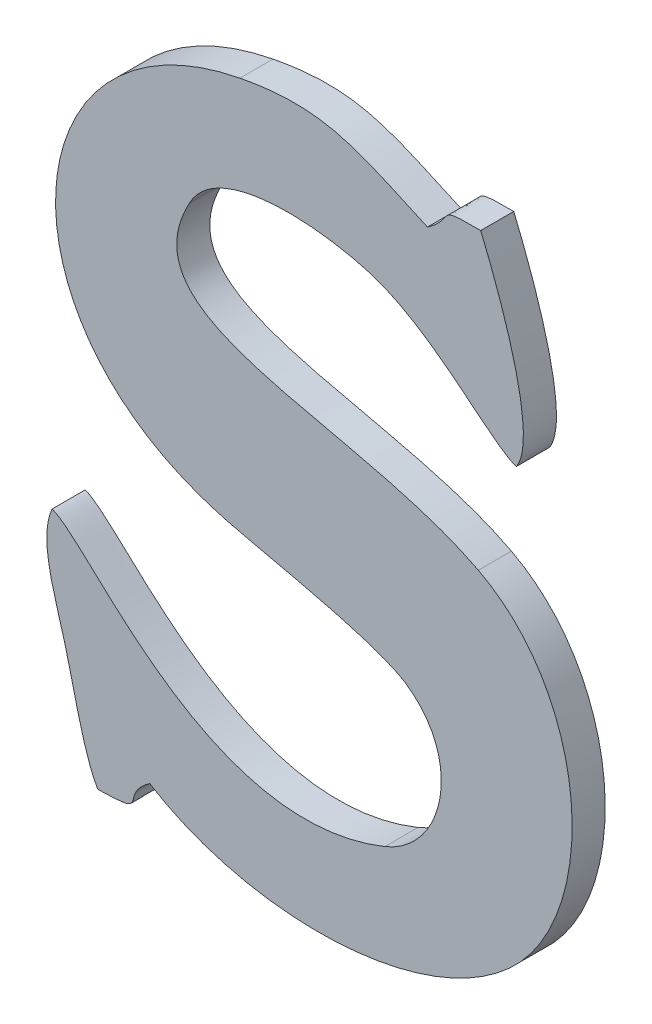
ISO-10303-21;
HEADER;
FILE_DESCRIPTION(('STEP AP214'),'2;1');
FILE_NAME('part.step','',(''),(''),'','','');
FILE_SCHEMA(('AUTOMOTIVE_DESIGN { 1 0 10303 214 1 1 1 1 }'));
ENDSEC;
DATA;
#1=APPLICATION_CONTEXT('core data for automotive mechanical design processes');
#2=APPLICATION_PROTOCOL_DEFINITION('international standard','automotive_design',2000,#1);
#3=PRODUCT_CONTEXT('',#1,'mechanical');
#4=PRODUCT('Part','Part','',(#3));
#5=PRODUCT_RELATED_PRODUCT_CATEGORY('part','',(#4));
#6=PRODUCT_DEFINITION_FORMATION('','',#4);
#7=PRODUCT_DEFINITION_CONTEXT('part definition',#1,'design');
#8=PRODUCT_DEFINITION('design','',#6,#7);
#9=PRODUCT_DEFINITION_SHAPE('','',#8);
#10=(LENGTH_UNIT() NAMED_UNIT(*) SI_UNIT(.MILLI.,.METRE.));
#11=(NAMED_UNIT(*) PLANE_ANGLE_UNIT() SI_UNIT($,.RADIAN.));
#12=(NAMED_UNIT(*) SI_UNIT($,.STERADIAN.) SOLID_ANGLE_UNIT());
#13=UNCERTAINTY_MEASURE_WITH_UNIT(LENGTH_MEASURE(1.E-05),#10,'distance_accuracy_value','');
#14=(GEOMETRIC_REPRESENTATION_CONTEXT(3) GLOBAL_UNCERTAINTY_ASSIGNED_CONTEXT((#13)) GLOBAL_UNIT_ASSIGNED_CONTEXT((#10,
#11,#12)) REPRESENTATION_CONTEXT('',''));
#15=CARTESIAN_POINT('',(0.,0.,0.));
#16=DIRECTION('',(0.,0.,1.));
#17=DIRECTION('',(1.,0.,0.));
#18=AXIS2_PLACEMENT_3D('',#15,#16,#17);
#19=CARTESIAN_POINT('',(50.1981159999998,11.237691,0.001));
#20=CARTESIAN_POINT('',(50.1981159999998,11.237691,0.));
#21=CARTESIAN_POINT('',(50.1998939999998,11.236487,0.001));
#22=CARTESIAN_POINT('',(50.1998939999998,11.236487,0.));
#23=CARTESIAN_POINT('',(50.1993199999998,11.233841,0.001));
#24=CARTESIAN_POINT('',(50.1993199999998,11.233841,0.));
#25=CARTESIAN_POINT('',(50.1974859999998,11.233099,0.001));
#26=CARTESIAN_POINT('',(50.1974859999998,11.233099,0.));
#27=B_SPLINE_SURFACE_WITH_KNOTS('',3,1,((#19,#20),(#21,#22),(#23,#24),(#25,#26)),.UNSPECIFIED.,
.F.,.F.,.F.,(4,4),(2,2),(0.8125,0.875),(0.,1.),.UNSPECIFIED.);
#28=CARTESIAN_POINT('',(50.1981159999998,11.237691,0.));
#29=CARTESIAN_POINT('',(50.1998939999998,11.236487,0.));
#30=CARTESIAN_POINT('',(50.1993199999998,11.233841,0.));
#31=CARTESIAN_POINT('',(50.1974859999998,11.233099,0.));
#32=B_SPLINE_CURVE_WITH_KNOTS('',3,(#28,#29,#30,#31),.UNSPECIFIED.,.F.,.F.,(4,4),(0.8125,0.875),.UNSPECIFIED.);
#33=CARTESIAN_POINT('',(50.1981159999998,11.237691,0.));
#34=VERTEX_POINT('',#33);
#35=CARTESIAN_POINT('',(50.1974859999998,11.233099,0.));
#36=VERTEX_POINT('',#35);
#37=EDGE_CURVE('E11',#34,#36,#32,.T.);
#38=DIRECTION('',(0.,0.,-1.));
#39=VECTOR('',#38,1.);
#40=CARTESIAN_POINT('',(50.1974859999998,11.233099,0.001));
#41=LINE('',#40,#39);
#42=CARTESIAN_POINT('',(50.1974859999998,11.233099,0.001));
#43=VERTEX_POINT('',#42);
#44=EDGE_CURVE('E28',#43,#36,#41,.T.);
#45=CARTESIAN_POINT('',(50.1981159999998,11.237691,0.001));
#46=CARTESIAN_POINT('',(50.1998939999998,11.236487,0.001));
#47=CARTESIAN_POINT('',(50.1993199999998,11.233841,0.001));
#48=CARTESIAN_POINT('',(50.1974859999998,11.233099,0.001));
#49=B_SPLINE_CURVE_WITH_KNOTS('',3,(#45,#46,#47,#48),.UNSPECIFIED.,.F.,.F.,(4,4),(0.8125,0.875),.UNSPECIFIED.);
#50=CARTESIAN_POINT('',(50.1981159999998,11.237691,0.001));
#51=VERTEX_POINT('',#50);
#52=EDGE_CURVE('E375',#51,#43,#49,.T.);
#53=DIRECTION('',(0.,0.,-1.));
#54=VECTOR('',#53,1.);
#55=CARTESIAN_POINT('',(50.1981159999998,11.237691,0.001));
#56=LINE('',#55,#54);
#57=EDGE_CURVE('E40',#51,#34,#56,.T.);
#58=ORIENTED_EDGE('',*,*,#37,.T.);
#59=ORIENTED_EDGE('',*,*,#44,.F.);
#60=ORIENTED_EDGE('',*,*,#52,.F.);
#61=ORIENTED_EDGE('',*,*,#57,.T.);
#62=EDGE_LOOP('',(#58,#59,#60,#61));
#63=FACE_BOUND('',#62,.T.);
#64=ADVANCED_FACE('F17',(#63),#27,.F.);
#65=CARTESIAN_POINT('',(50.1974859999998,11.233099,0.001));
#66=CARTESIAN_POINT('',(50.1974859999998,11.233099,0.));
#67=CARTESIAN_POINT('',(50.1921519999998,11.230957,0.001));
#68=CARTESIAN_POINT('',(50.1921519999998,11.230957,0.));
#69=CARTESIAN_POINT('',(50.1885399999998,11.236585,0.001));
#70=CARTESIAN_POINT('',(50.1885399999998,11.236585,0.));
#71=CARTESIAN_POINT('',(50.1874199999998,11.236907,0.001));
#72=CARTESIAN_POINT('',(50.1874199999998,11.236907,0.));
#73=B_SPLINE_SURFACE_WITH_KNOTS('',3,1,((#65,#66),(#67,#68),(#69,#70),(#71,#72)),.UNSPECIFIED.,
.F.,.F.,.F.,(4,4),(2,2),(0.875,1.),(0.,1.),.UNSPECIFIED.);
#74=CARTESIAN_POINT('',(50.1974859999998,11.233099,0.));
#75=CARTESIAN_POINT('',(50.1921519999998,11.230957,0.));
#76=CARTESIAN_POINT('',(50.1885399999998,11.236585,0.));
#77=CARTESIAN_POINT('',(50.1874199999998,11.236907,0.));
#78=B_SPLINE_CURVE_WITH_KNOTS('',3,(#74,#75,#76,#77),.UNSPECIFIED.,.F.,.F.,(4,4),(0.875,1.),.UNSPECIFIED.);
#79=CARTESIAN_POINT('',(50.1874199999998,11.236907,0.));
#80=VERTEX_POINT('',#79);
#81=EDGE_CURVE('E367',#36,#80,#78,.T.);
#82=DIRECTION('',(0.,0.,-1.));
#83=VECTOR('',#82,1.);
#84=CARTESIAN_POINT('',(50.1874199999998,11.236907,0.001));
#85=LINE('',#84,#83);
#86=CARTESIAN_POINT('',(50.1874199999998,11.236907,0.001));
#87=VERTEX_POINT('',#86);
#88=EDGE_CURVE('E362',#87,#80,#85,.T.);
#89=CARTESIAN_POINT('',(50.1974859999998,11.233099,0.001));
#90=CARTESIAN_POINT('',(50.1921519999998,11.230957,0.001));
#91=CARTESIAN_POINT('',(50.1885399999998,11.236585,0.001));
#92=CARTESIAN_POINT('',(50.1874199999998,11.236907,0.001));
#93=B_SPLINE_CURVE_WITH_KNOTS('',3,(#89,#90,#91,#92),.UNSPECIFIED.,.F.,.F.,(4,4),(0.875,1.),.UNSPECIFIED.);
#94=EDGE_CURVE('E355',#43,#87,#93,.T.);
#95=ORIENTED_EDGE('',*,*,#81,.T.);
#96=ORIENTED_EDGE('',*,*,#88,.F.);
#97=ORIENTED_EDGE('',*,*,#94,.F.);
#98=ORIENTED_EDGE('',*,*,#44,.T.);
#99=EDGE_LOOP('',(#95,#96,#97,#98));
#100=FACE_BOUND('',#99,.T.);
#101=ADVANCED_FACE('F383',(#100),#73,.F.);
#102=CARTESIAN_POINT('',(50.1874199999998,11.236907,0.001));
#103=CARTESIAN_POINT('',(50.1874199999998,11.236907,0.));
#104=CARTESIAN_POINT('',(50.1869999999998,11.235941,0.001));
#105=CARTESIAN_POINT('',(50.1869999999998,11.235941,0.));
#106=CARTESIAN_POINT('',(50.1875319999998,11.234625,0.001));
#107=CARTESIAN_POINT('',(50.1875319999998,11.234625,0.));
#108=CARTESIAN_POINT('',(50.1877979999998,11.233617,0.001));
#109=CARTESIAN_POINT('',(50.1877979999998,11.233617,0.));
#110=B_SPLINE_SURFACE_WITH_KNOTS('',3,1,((#102,#103),(#104,#105),(#106,#107),(#108,#109)),
.UNSPECIFIED.,.F.,.F.,.F.,(4,4),(2,2),(0.,0.0625),(0.,1.),.UNSPECIFIED.);
#111=CARTESIAN_POINT('',(50.1874199999998,11.236907,0.));
#112=CARTESIAN_POINT('',(50.1869999999998,11.235941,0.));
#113=CARTESIAN_POINT('',(50.1875319999998,11.234625,0.));
#114=CARTESIAN_POINT('',(50.1877979999998,11.233617,0.));
#115=B_SPLINE_CURVE_WITH_KNOTS('',3,(#111,#112,#113,#114),.UNSPECIFIED.,.F.,.F.,(4,4),(0.,
0.0625),.UNSPECIFIED.);
#116=CARTESIAN_POINT('',(50.1877979999998,11.233617,0.));
#117=VERTEX_POINT('',#116);
#118=EDGE_CURVE('E350',#80,#117,#115,.T.);
#119=DIRECTION('',(0.,0.,-1.));
#120=VECTOR('',#119,1.);
#121=CARTESIAN_POINT('',(50.1877979999998,11.233617,0.001));
#122=LINE('',#121,#120);
#123=CARTESIAN_POINT('',(50.1877979999998,11.233617,0.001));
#124=VERTEX_POINT('',#123);
#125=EDGE_CURVE('E345',#124,#117,#122,.T.);
#126=CARTESIAN_POINT('',(50.1874199999998,11.236907,0.001));
#127=CARTESIAN_POINT('',(50.1869999999998,11.235941,0.001));
#128=CARTESIAN_POINT('',(50.1875319999998,11.234625,0.001));
#129=CARTESIAN_POINT('',(50.1877979999998,11.233617,0.001));
#130=B_SPLINE_CURVE_WITH_KNOTS('',3,(#126,#127,#128,#129),.UNSPECIFIED.,.F.,.F.,(4,4),(0.,
0.0625),.UNSPECIFIED.);
#131=EDGE_CURVE('E338',#87,#124,#130,.T.);
#132=ORIENTED_EDGE('',*,*,#118,.T.);
#133=ORIENTED_EDGE('',*,*,#125,.F.);
#134=ORIENTED_EDGE('',*,*,#131,.F.);
#135=ORIENTED_EDGE('',*,*,#88,.T.);
#136=EDGE_LOOP('',(#132,#133,#134,#135));
#137=FACE_BOUND('',#136,.T.);
#138=ADVANCED_FACE('F388',(#137),#110,.F.);
#139=CARTESIAN_POINT('',(50.1877979999998,11.233617,0.001));
#140=CARTESIAN_POINT('',(50.1877979999998,11.233617,0.));
#141=CARTESIAN_POINT('',(50.1880359999998,11.232791,0.001));
#142=CARTESIAN_POINT('',(50.1880359999998,11.232791,0.));
#143=CARTESIAN_POINT('',(50.1883719999998,11.230943,0.001));
#144=CARTESIAN_POINT('',(50.1883719999998,11.230943,0.));
#145=CARTESIAN_POINT('',(50.1888059999998,11.230257,0.001));
#146=CARTESIAN_POINT('',(50.1888059999998,11.230257,0.));
#147=B_SPLINE_SURFACE_WITH_KNOTS('',3,1,((#139,#140),(#141,#142),(#143,#144),(#145,#146)),
.UNSPECIFIED.,.F.,.F.,.F.,(4,4),(2,2),(0.0625,0.125),(0.,1.),.UNSPECIFIED.);
#148=CARTESIAN_POINT('',(50.1877979999998,11.233617,0.));
#149=CARTESIAN_POINT('',(50.1880359999998,11.232791,0.));
#150=CARTESIAN_POINT('',(50.1883719999998,11.230943,0.));
#151=CARTESIAN_POINT('',(50.1888059999998,11.230257,0.));
#152=B_SPLINE_CURVE_WITH_KNOTS('',3,(#148,#149,#150,#151),.UNSPECIFIED.,.F.,.F.,(4,4),(0.0625,
0.125),.UNSPECIFIED.);
#153=CARTESIAN_POINT('',(50.1888059999998,11.230257,0.));
#154=VERTEX_POINT('',#153);
#155=EDGE_CURVE('E333',#117,#154,#152,.T.);
#156=DIRECTION('',(0.,0.,-1.));
#157=VECTOR('',#156,1.);
#158=CARTESIAN_POINT('',(50.1888059999998,11.230257,0.001));
#159=LINE('',#158,#157);
#160=CARTESIAN_POINT('',(50.1888059999998,11.230257,0.001));
#161=VERTEX_POINT('',#160);
#162=EDGE_CURVE('E328',#161,#154,#159,.T.);
#163=CARTESIAN_POINT('',(50.1877979999998,11.233617,0.001));
#164=CARTESIAN_POINT('',(50.1880359999998,11.232791,0.001));
#165=CARTESIAN_POINT('',(50.1883719999998,11.230943,0.001));
#166=CARTESIAN_POINT('',(50.1888059999998,11.230257,0.001));
#167=B_SPLINE_CURVE_WITH_KNOTS('',3,(#163,#164,#165,#166),.UNSPECIFIED.,.F.,.F.,(4,4),(0.0625,
0.125),.UNSPECIFIED.);
#168=EDGE_CURVE('E321',#124,#161,#167,.T.);
#169=ORIENTED_EDGE('',*,*,#155,.T.);
#170=ORIENTED_EDGE('',*,*,#162,.F.);
#171=ORIENTED_EDGE('',*,*,#168,.F.);
#172=ORIENTED_EDGE('',*,*,#125,.T.);
#173=EDGE_LOOP('',(#169,#170,#171,#172));
#174=FACE_BOUND('',#173,.T.);
#175=ADVANCED_FACE('F394',(#174),#147,.F.);
#176=CARTESIAN_POINT('',(50.1888059999998,11.230257,0.001));
#177=CARTESIAN_POINT('',(50.1888059999998,11.230257,0.));
#178=CARTESIAN_POINT('',(50.1905139999998,11.230285,0.001));
#179=CARTESIAN_POINT('',(50.1905139999998,11.230285,0.));
#180=CARTESIAN_POINT('',(50.1893799999998,11.230481,0.001));
#181=CARTESIAN_POINT('',(50.1893799999998,11.230481,0.));
#182=CARTESIAN_POINT('',(50.1903739999998,11.231195,0.001));
#183=CARTESIAN_POINT('',(50.1903739999998,11.231195,0.));
#184=B_SPLINE_SURFACE_WITH_KNOTS('',3,1,((#176,#177),(#178,#179),(#180,#181),(#182,#183)),
.UNSPECIFIED.,.F.,.F.,.F.,(4,4),(2,2),(0.125,0.1875),(0.,1.),.UNSPECIFIED.);
#185=CARTESIAN_POINT('',(50.1888059999998,11.230257,0.));
#186=CARTESIAN_POINT('',(50.1905139999998,11.230285,0.));
#187=CARTESIAN_POINT('',(50.1893799999998,11.230481,0.));
#188=CARTESIAN_POINT('',(50.1903739999998,11.231195,0.));
#189=B_SPLINE_CURVE_WITH_KNOTS('',3,(#185,#186,#187,#188),.UNSPECIFIED.,.F.,.F.,(4,4),(0.125,
0.1875),.UNSPECIFIED.);
#190=CARTESIAN_POINT('',(50.1903739999998,11.231195,0.));
#191=VERTEX_POINT('',#190);
#192=EDGE_CURVE('E316',#154,#191,#189,.T.);
#193=DIRECTION('',(0.,0.,-1.));
#194=VECTOR('',#193,1.);
#195=CARTESIAN_POINT('',(50.1903739999998,11.231195,0.001));
#196=LINE('',#195,#194);
#197=CARTESIAN_POINT('',(50.1903739999998,11.231195,0.001));
#198=VERTEX_POINT('',#197);
#199=EDGE_CURVE('E311',#198,#191,#196,.T.);
#200=CARTESIAN_POINT('',(50.1888059999998,11.230257,0.001));
#201=CARTESIAN_POINT('',(50.1905139999998,11.230285,0.001));
#202=CARTESIAN_POINT('',(50.1893799999998,11.230481,0.001));
#203=CARTESIAN_POINT('',(50.1903739999998,11.231195,0.001));
#204=B_SPLINE_CURVE_WITH_KNOTS('',3,(#200,#201,#202,#203),.UNSPECIFIED.,.F.,.F.,(4,4),(0.125,
0.1875),.UNSPECIFIED.);
#205=EDGE_CURVE('E304',#161,#198,#204,.T.);
#206=ORIENTED_EDGE('',*,*,#192,.T.);
#207=ORIENTED_EDGE('',*,*,#199,.F.);
#208=ORIENTED_EDGE('',*,*,#205,.F.);
#209=ORIENTED_EDGE('',*,*,#162,.T.);
#210=EDGE_LOOP('',(#206,#207,#208,#209));
#211=FACE_BOUND('',#210,.T.);
#212=ADVANCED_FACE('F398',(#211),#184,.F.);
#213=CARTESIAN_POINT('',(50.1903739999998,11.231195,0.001));
#214=CARTESIAN_POINT('',(50.1903739999998,11.231195,0.));
#215=CARTESIAN_POINT('',(50.1933839999998,11.229305,0.001));
#216=CARTESIAN_POINT('',(50.1933839999998,11.229305,0.));
#217=CARTESIAN_POINT('',(50.1985359999998,11.229333,0.001));
#218=CARTESIAN_POINT('',(50.1985359999998,11.229333,0.));
#219=CARTESIAN_POINT('',(50.2012519999998,11.231797,0.001));
#220=CARTESIAN_POINT('',(50.2012519999998,11.231797,0.));
#221=B_SPLINE_SURFACE_WITH_KNOTS('',3,1,((#213,#214),(#215,#216),(#217,#218),(#219,#220)),
.UNSPECIFIED.,.F.,.F.,.F.,(4,4),(2,2),(0.1875,0.25),(0.,1.),.UNSPECIFIED.);
#222=CARTESIAN_POINT('',(50.1903739999998,11.231195,0.));
#223=CARTESIAN_POINT('',(50.1933839999998,11.229305,0.));
#224=CARTESIAN_POINT('',(50.1985359999998,11.229333,0.));
#225=CARTESIAN_POINT('',(50.2012519999998,11.231797,0.));
#226=B_SPLINE_CURVE_WITH_KNOTS('',3,(#222,#223,#224,#225),.UNSPECIFIED.,.F.,.F.,(4,4),(0.1875,
0.25),.UNSPECIFIED.);
#227=CARTESIAN_POINT('',(50.2012519999998,11.231797,0.));
#228=VERTEX_POINT('',#227);
#229=EDGE_CURVE('E299',#191,#228,#226,.T.);
#230=DIRECTION('',(0.,0.,-1.));
#231=VECTOR('',#230,1.);
#232=CARTESIAN_POINT('',(50.2012519999998,11.231797,0.001));
#233=LINE('',#232,#231);
#234=CARTESIAN_POINT('',(50.2012519999998,11.231797,0.001));
#235=VERTEX_POINT('',#234);
#236=EDGE_CURVE('E294',#235,#228,#233,.T.);
#237=CARTESIAN_POINT('',(50.1903739999998,11.231195,0.001));
#238=CARTESIAN_POINT('',(50.1933839999998,11.229305,0.001));
#239=CARTESIAN_POINT('',(50.1985359999998,11.229333,0.001));
#240=CARTESIAN_POINT('',(50.2012519999998,11.231797,0.001));
#241=B_SPLINE_CURVE_WITH_KNOTS('',3,(#237,#238,#239,#240),.UNSPECIFIED.,.F.,.F.,(4,4),(0.1875,
0.25),.UNSPECIFIED.);
#242=EDGE_CURVE('E287',#198,#235,#241,.T.);
#243=ORIENTED_EDGE('',*,*,#229,.T.);
#244=ORIENTED_EDGE('',*,*,#236,.F.);
#245=ORIENTED_EDGE('',*,*,#242,.F.);
#246=ORIENTED_EDGE('',*,*,#199,.T.);
#247=EDGE_LOOP('',(#243,#244,#245,#246));
#248=FACE_BOUND('',#247,.T.);
#249=ADVANCED_FACE('F403',(#248),#221,.F.);
#250=CARTESIAN_POINT('',(50.2012519999998,11.231797,0.001));
#251=CARTESIAN_POINT('',(50.2012519999998,11.231797,0.));
#252=CARTESIAN_POINT('',(50.2040799999998,11.234359,0.001));
#253=CARTESIAN_POINT('',(50.2040799999998,11.234359,0.));
#254=CARTESIAN_POINT('',(50.2037299999998,11.239973,0.001));
#255=CARTESIAN_POINT('',(50.2037299999998,11.239973,0.));
#256=CARTESIAN_POINT('',(50.2003139999998,11.241751,0.001));
#257=CARTESIAN_POINT('',(50.2003139999998,11.241751,0.));
#258=B_SPLINE_SURFACE_WITH_KNOTS('',3,1,((#250,#251),(#252,#253),(#254,#255),(#256,#257)),
.UNSPECIFIED.,.F.,.F.,.F.,(4,4),(2,2),(0.25,0.3125),(0.,1.),.UNSPECIFIED.);
#259=CARTESIAN_POINT('',(50.2012519999998,11.231797,0.));
#260=CARTESIAN_POINT('',(50.2040799999998,11.234359,0.));
#261=CARTESIAN_POINT('',(50.2037299999998,11.239973,0.));
#262=CARTESIAN_POINT('',(50.2003139999998,11.241751,0.));
#263=B_SPLINE_CURVE_WITH_KNOTS('',3,(#259,#260,#261,#262),.UNSPECIFIED.,.F.,.F.,(4,4),(0.25,
0.3125),.UNSPECIFIED.);
#264=CARTESIAN_POINT('',(50.2003139999998,11.241751,0.));
#265=VERTEX_POINT('',#264);
#266=EDGE_CURVE('E282',#228,#265,#263,.T.);
#267=DIRECTION('',(0.,0.,-1.));
#268=VECTOR('',#267,1.);
#269=CARTESIAN_POINT('',(50.2003139999998,11.241751,0.001));
#270=LINE('',#269,#268);
#271=CARTESIAN_POINT('',(50.2003139999998,11.241751,0.001));
#272=VERTEX_POINT('',#271);
#273=EDGE_CURVE('E277',#272,#265,#270,.T.);
#274=CARTESIAN_POINT('',(50.2012519999998,11.231797,0.001));
#275=CARTESIAN_POINT('',(50.2040799999998,11.234359,0.001));
#276=CARTESIAN_POINT('',(50.2037299999998,11.239973,0.001));
#277=CARTESIAN_POINT('',(50.2003139999998,11.241751,0.001));
#278=B_SPLINE_CURVE_WITH_KNOTS('',3,(#274,#275,#276,#277),.UNSPECIFIED.,.F.,.F.,(4,4),(0.25,
0.3125),.UNSPECIFIED.);
#279=EDGE_CURVE('E270',#235,#272,#278,.T.);
#280=ORIENTED_EDGE('',*,*,#266,.T.);
#281=ORIENTED_EDGE('',*,*,#273,.F.);
#282=ORIENTED_EDGE('',*,*,#279,.F.);
#283=ORIENTED_EDGE('',*,*,#236,.T.);
#284=EDGE_LOOP('',(#280,#281,#282,#283));
#285=FACE_BOUND('',#284,.T.);
#286=ADVANCED_FACE('F409',(#285),#258,.F.);
#287=CARTESIAN_POINT('',(50.2003139999998,11.241751,0.001));
#288=CARTESIAN_POINT('',(50.2003139999998,11.241751,0.));
#289=CARTESIAN_POINT('',(50.1964639999998,11.243753,0.001));
#290=CARTESIAN_POINT('',(50.1964639999998,11.243753,0.));
#291=CARTESIAN_POINT('',(50.1894779999998,11.243109,0.001));
#292=CARTESIAN_POINT('',(50.1894779999998,11.243109,0.));
#293=CARTESIAN_POINT('',(50.1915779999998,11.247001,0.001));
#294=CARTESIAN_POINT('',(50.1915779999998,11.247001,0.));
#295=B_SPLINE_SURFACE_WITH_KNOTS('',3,1,((#287,#288),(#289,#290),(#291,#292),(#293,#294)),
.UNSPECIFIED.,.F.,.F.,.F.,(4,4),(2,2),(0.3125,0.375),(0.,1.),.UNSPECIFIED.);
#296=CARTESIAN_POINT('',(50.2003139999998,11.241751,0.));
#297=CARTESIAN_POINT('',(50.1964639999998,11.243753,0.));
#298=CARTESIAN_POINT('',(50.1894779999998,11.243109,0.));
#299=CARTESIAN_POINT('',(50.1915779999998,11.247001,0.));
#300=B_SPLINE_CURVE_WITH_KNOTS('',3,(#296,#297,#298,#299),.UNSPECIFIED.,.F.,.F.,(4,4),(0.3125,
0.375),.UNSPECIFIED.);
#301=CARTESIAN_POINT('',(50.1915779999998,11.247001,0.));
#302=VERTEX_POINT('',#301);
#303=EDGE_CURVE('E265',#265,#302,#300,.T.);
#304=DIRECTION('',(0.,0.,-1.));
#305=VECTOR('',#304,1.);
#306=CARTESIAN_POINT('',(50.1915779999998,11.247001,0.001));
#307=LINE('',#306,#305);
#308=CARTESIAN_POINT('',(50.1915779999998,11.247001,0.001));
#309=VERTEX_POINT('',#308);
#310=EDGE_CURVE('E260',#309,#302,#307,.T.);
#311=CARTESIAN_POINT('',(50.2003139999998,11.241751,0.001));
#312=CARTESIAN_POINT('',(50.1964639999998,11.243753,0.001));
#313=CARTESIAN_POINT('',(50.1894779999998,11.243109,0.001));
#314=CARTESIAN_POINT('',(50.1915779999998,11.247001,0.001));
#315=B_SPLINE_CURVE_WITH_KNOTS('',3,(#311,#312,#313,#314),.UNSPECIFIED.,.F.,.F.,(4,4),(0.3125,
0.375),.UNSPECIFIED.);
#316=EDGE_CURVE('E253',#272,#309,#315,.T.);
#317=ORIENTED_EDGE('',*,*,#303,.T.);
#318=ORIENTED_EDGE('',*,*,#310,.F.);
#319=ORIENTED_EDGE('',*,*,#316,.F.);
#320=ORIENTED_EDGE('',*,*,#273,.T.);
#321=EDGE_LOOP('',(#317,#318,#319,#320));
#322=FACE_BOUND('',#321,.T.);
#323=ADVANCED_FACE('F413',(#322),#295,.F.);
#324=CARTESIAN_POINT('',(50.1915779999998,11.247001,0.001));
#325=CARTESIAN_POINT('',(50.1915779999998,11.247001,0.));
#326=CARTESIAN_POINT('',(50.1924599999998,11.248653,0.001));
#327=CARTESIAN_POINT('',(50.1924599999998,11.248653,0.));
#328=CARTESIAN_POINT('',(50.1955959999998,11.248345,0.001));
#329=CARTESIAN_POINT('',(50.1955959999998,11.248345,0.));
#330=CARTESIAN_POINT('',(50.1970659999998,11.247883,0.001));
#331=CARTESIAN_POINT('',(50.1970659999998,11.247883,0.));
#332=B_SPLINE_SURFACE_WITH_KNOTS('',3,1,((#324,#325),(#326,#327),(#328,#329),(#330,#331)),
.UNSPECIFIED.,.F.,.F.,.F.,(4,4),(2,2),(0.375,0.4375),(0.,1.),.UNSPECIFIED.);
#333=CARTESIAN_POINT('',(50.1915779999998,11.247001,0.));
#334=CARTESIAN_POINT('',(50.1924599999998,11.248653,0.));
#335=CARTESIAN_POINT('',(50.1955959999998,11.248345,0.));
#336=CARTESIAN_POINT('',(50.1970659999998,11.247883,0.));
#337=B_SPLINE_CURVE_WITH_KNOTS('',3,(#333,#334,#335,#336),.UNSPECIFIED.,.F.,.F.,(4,4),(0.375,
0.4375),.UNSPECIFIED.);
#338=CARTESIAN_POINT('',(50.1970659999998,11.247883,0.));
#339=VERTEX_POINT('',#338);
#340=EDGE_CURVE('E248',#302,#339,#337,.T.);
#341=DIRECTION('',(0.,0.,-1.));
#342=VECTOR('',#341,1.);
#343=CARTESIAN_POINT('',(50.1970659999998,11.247883,0.001));
#344=LINE('',#343,#342);
#345=CARTESIAN_POINT('',(50.1970659999998,11.247883,0.001));
#346=VERTEX_POINT('',#345);
#347=EDGE_CURVE('E243',#346,#339,#344,.T.);
#348=CARTESIAN_POINT('',(50.1915779999998,11.247001,0.001));
#349=CARTESIAN_POINT('',(50.1924599999998,11.248653,0.001));
#350=CARTESIAN_POINT('',(50.1955959999998,11.248345,0.001));
#351=CARTESIAN_POINT('',(50.1970659999998,11.247883,0.001));
#352=B_SPLINE_CURVE_WITH_KNOTS('',3,(#348,#349,#350,#351),.UNSPECIFIED.,.F.,.F.,(4,4),(0.375,
0.4375),.UNSPECIFIED.);
#353=EDGE_CURVE('E236',#309,#346,#352,.T.);
#354=ORIENTED_EDGE('',*,*,#340,.T.);
#355=ORIENTED_EDGE('',*,*,#347,.F.);
#356=ORIENTED_EDGE('',*,*,#353,.F.);
#357=ORIENTED_EDGE('',*,*,#310,.T.);
#358=EDGE_LOOP('',(#354,#355,#356,#357));
#359=FACE_BOUND('',#358,.T.);
#360=ADVANCED_FACE('F418',(#359),#332,.F.);
#361=CARTESIAN_POINT('',(50.1970659999998,11.247883,0.001));
#362=CARTESIAN_POINT('',(50.1970659999998,11.247883,0.));
#363=CARTESIAN_POINT('',(50.1989979999998,11.247281,0.001));
#364=CARTESIAN_POINT('',(50.1989979999998,11.247281,0.));
#365=CARTESIAN_POINT('',(50.2006779999998,11.245279,0.001));
#366=CARTESIAN_POINT('',(50.2006779999998,11.245279,0.));
#367=CARTESIAN_POINT('',(50.2014619999998,11.245041,0.001));
#368=CARTESIAN_POINT('',(50.2014619999998,11.245041,0.));
#369=B_SPLINE_SURFACE_WITH_KNOTS('',3,1,((#361,#362),(#363,#364),(#365,#366),(#367,#368)),
.UNSPECIFIED.,.F.,.F.,.F.,(4,4),(2,2),(0.4375,0.5),(0.,1.),.UNSPECIFIED.);
#370=CARTESIAN_POINT('',(50.1970659999998,11.247883,0.));
#371=CARTESIAN_POINT('',(50.1989979999998,11.247281,0.));
#372=CARTESIAN_POINT('',(50.2006779999998,11.245279,0.));
#373=CARTESIAN_POINT('',(50.2014619999998,11.245041,0.));
#374=B_SPLINE_CURVE_WITH_KNOTS('',3,(#370,#371,#372,#373),.UNSPECIFIED.,.F.,.F.,(4,4),(0.4375,
0.5),.UNSPECIFIED.);
#375=CARTESIAN_POINT('',(50.2014619999998,11.245041,0.));
#376=VERTEX_POINT('',#375);
#377=EDGE_CURVE('E231',#339,#376,#374,.T.);
#378=DIRECTION('',(0.,0.,-1.));
#379=VECTOR('',#378,1.);
#380=CARTESIAN_POINT('',(50.2014619999998,11.245041,0.001));
#381=LINE('',#380,#379);
#382=CARTESIAN_POINT('',(50.2014619999998,11.245041,0.001));
#383=VERTEX_POINT('',#382);
#384=EDGE_CURVE('E226',#383,#376,#381,.T.);
#385=CARTESIAN_POINT('',(50.1970659999998,11.247883,0.001));
#386=CARTESIAN_POINT('',(50.1989979999998,11.247281,0.001));
#387=CARTESIAN_POINT('',(50.2006779999998,11.245279,0.001));
#388=CARTESIAN_POINT('',(50.2014619999998,11.245041,0.001));
#389=B_SPLINE_CURVE_WITH_KNOTS('',3,(#385,#386,#387,#388),.UNSPECIFIED.,.F.,.F.,(4,4),(0.4375,
0.5),.UNSPECIFIED.);
#390=EDGE_CURVE('E219',#346,#383,#389,.T.);
#391=ORIENTED_EDGE('',*,*,#377,.T.);
#392=ORIENTED_EDGE('',*,*,#384,.F.);
#393=ORIENTED_EDGE('',*,*,#390,.F.);
#394=ORIENTED_EDGE('',*,*,#347,.T.);
#395=EDGE_LOOP('',(#391,#392,#393,#394));
#396=FACE_BOUND('',#395,.T.);
#397=ADVANCED_FACE('F424',(#396),#369,.F.);
#398=CARTESIAN_POINT('',(50.2014619999998,11.245041,0.001));
#399=CARTESIAN_POINT('',(50.2014619999998,11.245041,0.));
#400=CARTESIAN_POINT('',(50.2021759999998,11.246105,0.001));
#401=CARTESIAN_POINT('',(50.2021759999998,11.246105,0.));
#402=CARTESIAN_POINT('',(50.2009019999998,11.249465,0.001));
#403=CARTESIAN_POINT('',(50.2009019999998,11.249465,0.));
#404=CARTESIAN_POINT('',(50.2003839999998,11.250683,0.001));
#405=CARTESIAN_POINT('',(50.2003839999998,11.250683,0.));
#406=B_SPLINE_SURFACE_WITH_KNOTS('',3,1,((#398,#399),(#400,#401),(#402,#403),(#404,#405)),
.UNSPECIFIED.,.F.,.F.,.F.,(4,4),(2,2),(0.5,0.5625),(0.,1.),.UNSPECIFIED.);
#407=CARTESIAN_POINT('',(50.2014619999998,11.245041,0.));
#408=CARTESIAN_POINT('',(50.2021759999998,11.246105,0.));
#409=CARTESIAN_POINT('',(50.2009019999998,11.249465,0.));
#410=CARTESIAN_POINT('',(50.2003839999998,11.250683,0.));
#411=B_SPLINE_CURVE_WITH_KNOTS('',3,(#407,#408,#409,#410),.UNSPECIFIED.,.F.,.F.,(4,4),(0.5,
0.5625),.UNSPECIFIED.);
#412=CARTESIAN_POINT('',(50.2003839999998,11.250683,0.));
#413=VERTEX_POINT('',#412);
#414=EDGE_CURVE('E214',#376,#413,#411,.T.);
#415=DIRECTION('',(0.,0.,-1.));
#416=VECTOR('',#415,1.);
#417=CARTESIAN_POINT('',(50.2003839999998,11.250683,0.001));
#418=LINE('',#417,#416);
#419=CARTESIAN_POINT('',(50.2003839999998,11.250683,0.001));
#420=VERTEX_POINT('',#419);
#421=EDGE_CURVE('E209',#420,#413,#418,.T.);
#422=CARTESIAN_POINT('',(50.2014619999998,11.245041,0.001));
#423=CARTESIAN_POINT('',(50.2021759999998,11.246105,0.001));
#424=CARTESIAN_POINT('',(50.2009019999998,11.249465,0.001));
#425=CARTESIAN_POINT('',(50.2003839999998,11.250683,0.001));
#426=B_SPLINE_CURVE_WITH_KNOTS('',3,(#422,#423,#424,#425),.UNSPECIFIED.,.F.,.F.,(4,4),(0.5,
0.5625),.UNSPECIFIED.);
#427=EDGE_CURVE('E202',#383,#420,#426,.T.);
#428=ORIENTED_EDGE('',*,*,#414,.T.);
#429=ORIENTED_EDGE('',*,*,#421,.F.);
#430=ORIENTED_EDGE('',*,*,#427,.F.);
#431=ORIENTED_EDGE('',*,*,#384,.T.);
#432=EDGE_LOOP('',(#428,#429,#430,#431));
#433=FACE_BOUND('',#432,.T.);
#434=ADVANCED_FACE('F428',(#433),#406,.F.);
#435=CARTESIAN_POINT('',(50.2003839999998,11.250683,0.001));
#436=CARTESIAN_POINT('',(50.2003839999998,11.250683,0.));
#437=CARTESIAN_POINT('',(50.1989139999998,11.250697,0.001));
#438=CARTESIAN_POINT('',(50.1989139999998,11.250697,0.));
#439=CARTESIAN_POINT('',(50.1996839999998,11.250599,0.001));
#440=CARTESIAN_POINT('',(50.1996839999998,11.250599,0.));
#441=CARTESIAN_POINT('',(50.1987739999998,11.249969,0.001));
#442=CARTESIAN_POINT('',(50.1987739999998,11.249969,0.));
#443=B_SPLINE_SURFACE_WITH_KNOTS('',3,1,((#435,#436),(#437,#438),(#439,#440),(#441,#442)),
.UNSPECIFIED.,.F.,.F.,.F.,(4,4),(2,2),(0.5625,0.625),(0.,1.),.UNSPECIFIED.);
#444=CARTESIAN_POINT('',(50.2003839999998,11.250683,0.));
#445=CARTESIAN_POINT('',(50.1989139999998,11.250697,0.));
#446=CARTESIAN_POINT('',(50.1996839999998,11.250599,0.));
#447=CARTESIAN_POINT('',(50.1987739999998,11.249969,0.));
#448=B_SPLINE_CURVE_WITH_KNOTS('',3,(#444,#445,#446,#447),.UNSPECIFIED.,.F.,.F.,(4,4),(0.5625,
0.625),.UNSPECIFIED.);
#449=CARTESIAN_POINT('',(50.1987739999998,11.249969,0.));
#450=VERTEX_POINT('',#449);
#451=EDGE_CURVE('E197',#413,#450,#448,.T.);
#452=DIRECTION('',(0.,0.,-1.));
#453=VECTOR('',#452,1.);
#454=CARTESIAN_POINT('',(50.1987739999998,11.249969,0.001));
#455=LINE('',#454,#453);
#456=CARTESIAN_POINT('',(50.1987739999998,11.249969,0.001));
#457=VERTEX_POINT('',#456);
#458=EDGE_CURVE('E192',#457,#450,#455,.T.);
#459=CARTESIAN_POINT('',(50.2003839999998,11.250683,0.001));
#460=CARTESIAN_POINT('',(50.1989139999998,11.250697,0.001));
#461=CARTESIAN_POINT('',(50.1996839999998,11.250599,0.001));
#462=CARTESIAN_POINT('',(50.1987739999998,11.249969,0.001));
#463=B_SPLINE_CURVE_WITH_KNOTS('',3,(#459,#460,#461,#462),.UNSPECIFIED.,.F.,.F.,(4,4),(0.5625,
0.625),.UNSPECIFIED.);
#464=EDGE_CURVE('E185',#420,#457,#463,.T.);
#465=ORIENTED_EDGE('',*,*,#451,.T.);
#466=ORIENTED_EDGE('',*,*,#458,.F.);
#467=ORIENTED_EDGE('',*,*,#464,.F.);
#468=ORIENTED_EDGE('',*,*,#421,.T.);
#469=EDGE_LOOP('',(#465,#466,#467,#468));
#470=FACE_BOUND('',#469,.T.);
#471=ADVANCED_FACE('F433',(#470),#443,.F.);
#472=CARTESIAN_POINT('',(50.1987739999998,11.249969,0.001));
#473=CARTESIAN_POINT('',(50.1987739999998,11.249969,0.));
#474=CARTESIAN_POINT('',(50.1965899999998,11.250949,0.001));
#475=CARTESIAN_POINT('',(50.1965899999998,11.250949,0.));
#476=CARTESIAN_POINT('',(50.1956519999998,11.251523,0.001));
#477=CARTESIAN_POINT('',(50.1956519999998,11.251523,0.));
#478=CARTESIAN_POINT('',(50.1931039999998,11.251033,0.001));
#479=CARTESIAN_POINT('',(50.1931039999998,11.251033,0.));
#480=B_SPLINE_SURFACE_WITH_KNOTS('',3,1,((#472,#473),(#474,#475),(#476,#477),(#478,#479)),
.UNSPECIFIED.,.F.,.F.,.F.,(4,4),(2,2),(0.625,0.6875),(0.,1.),.UNSPECIFIED.);
#481=CARTESIAN_POINT('',(50.1987739999998,11.249969,0.));
#482=CARTESIAN_POINT('',(50.1965899999998,11.250949,0.));
#483=CARTESIAN_POINT('',(50.1956519999998,11.251523,0.));
#484=CARTESIAN_POINT('',(50.1931039999998,11.251033,0.));
#485=B_SPLINE_CURVE_WITH_KNOTS('',3,(#481,#482,#483,#484),.UNSPECIFIED.,.F.,.F.,(4,4),(0.625,
0.6875),.UNSPECIFIED.);
#486=CARTESIAN_POINT('',(50.1931039999998,11.251033,0.));
#487=VERTEX_POINT('',#486);
#488=EDGE_CURVE('E180',#450,#487,#485,.T.);
#489=DIRECTION('',(0.,0.,-1.));
#490=VECTOR('',#489,1.);
#491=CARTESIAN_POINT('',(50.1931039999998,11.251033,0.001));
#492=LINE('',#491,#490);
#493=CARTESIAN_POINT('',(50.1931039999998,11.251033,0.001));
#494=VERTEX_POINT('',#493);
#495=EDGE_CURVE('E175',#494,#487,#492,.T.);
#496=CARTESIAN_POINT('',(50.1987739999998,11.249969,0.001));
#497=CARTESIAN_POINT('',(50.1965899999998,11.250949,0.001));
#498=CARTESIAN_POINT('',(50.1956519999998,11.251523,0.001));
#499=CARTESIAN_POINT('',(50.1931039999998,11.251033,0.001));
#500=B_SPLINE_CURVE_WITH_KNOTS('',3,(#496,#497,#498,#499),.UNSPECIFIED.,.F.,.F.,(4,4),(0.625,
0.6875),.UNSPECIFIED.);
#501=EDGE_CURVE('E133',#457,#494,#500,.T.);
#502=ORIENTED_EDGE('',*,*,#488,.T.);
#503=ORIENTED_EDGE('',*,*,#495,.F.);
#504=ORIENTED_EDGE('',*,*,#501,.F.);
#505=ORIENTED_EDGE('',*,*,#458,.T.);
#506=EDGE_LOOP('',(#502,#503,#504,#505));
#507=FACE_BOUND('',#506,.T.);
#508=ADVANCED_FACE('F436',(#507),#480,.F.);
#509=CARTESIAN_POINT('',(50.1931039999998,11.251033,0.001));
#510=CARTESIAN_POINT('',(50.1931039999998,11.251033,0.));
#511=CARTESIAN_POINT('',(50.1862439999998,11.249717,0.001));
#512=CARTESIAN_POINT('',(50.1862439999998,11.249717,0.));
#513=CARTESIAN_POINT('',(50.1852779999998,11.241219,0.001));
#514=CARTESIAN_POINT('',(50.1852779999998,11.241219,0.));
#515=CARTESIAN_POINT('',(50.1926559999998,11.239259,0.001));
#516=CARTESIAN_POINT('',(50.1926559999998,11.239259,0.));
#517=B_SPLINE_SURFACE_WITH_KNOTS('',3,1,((#509,#510),(#511,#512),(#513,#514),(#515,#516)),
.UNSPECIFIED.,.F.,.F.,.F.,(4,4),(2,2),(0.6875,0.75),(0.,1.),.UNSPECIFIED.);
#518=CARTESIAN_POINT('',(50.1931039999998,11.251033,0.));
#519=CARTESIAN_POINT('',(50.1862439999998,11.249717,0.));
#520=CARTESIAN_POINT('',(50.1852779999998,11.241219,0.));
#521=CARTESIAN_POINT('',(50.1926559999998,11.239259,0.));
#522=B_SPLINE_CURVE_WITH_KNOTS('',3,(#518,#519,#520,#521),.UNSPECIFIED.,.F.,.F.,(4,4),(0.6875,
0.75),.UNSPECIFIED.);
#523=CARTESIAN_POINT('',(50.1926559999998,11.239259,0.));
#524=VERTEX_POINT('',#523);
#525=EDGE_CURVE('E142',#487,#524,#522,.T.);
#526=DIRECTION('',(0.,0.,-1.));
#527=VECTOR('',#526,1.);
#528=CARTESIAN_POINT('',(50.1926559999998,11.239259,0.001));
#529=LINE('',#528,#527);
#530=CARTESIAN_POINT('',(50.1926559999998,11.239259,0.001));
#531=VERTEX_POINT('',#530);
#532=EDGE_CURVE('E136',#531,#524,#529,.T.);
#533=CARTESIAN_POINT('',(50.1931039999998,11.251033,0.001));
#534=CARTESIAN_POINT('',(50.1862439999998,11.249717,0.001));
#535=CARTESIAN_POINT('',(50.1852779999998,11.241219,0.001));
#536=CARTESIAN_POINT('',(50.1926559999998,11.239259,0.001));
#537=B_SPLINE_CURVE_WITH_KNOTS('',3,(#533,#534,#535,#536),.UNSPECIFIED.,.F.,.F.,(4,4),(0.6875,
0.75),.UNSPECIFIED.);
#538=EDGE_CURVE('E127',#494,#531,#537,.T.);
#539=ORIENTED_EDGE('',*,*,#525,.T.);
#540=ORIENTED_EDGE('',*,*,#532,.F.);
#541=ORIENTED_EDGE('',*,*,#538,.F.);
#542=ORIENTED_EDGE('',*,*,#495,.T.);
#543=EDGE_LOOP('',(#539,#540,#541,#542));
#544=FACE_BOUND('',#543,.T.);
#545=ADVANCED_FACE('F140',(#544),#517,.F.);
#546=CARTESIAN_POINT('',(50.1926559999998,11.239259,0.001));
#547=CARTESIAN_POINT('',(50.1926559999998,11.239259,0.));
#548=CARTESIAN_POINT('',(50.1939299999998,11.238923,0.001));
#549=CARTESIAN_POINT('',(50.1939299999998,11.238923,0.));
#550=CARTESIAN_POINT('',(50.1971219999998,11.238349,0.001));
#551=CARTESIAN_POINT('',(50.1971219999998,11.238349,0.));
#552=CARTESIAN_POINT('',(50.1981159999998,11.237691,0.001));
#553=CARTESIAN_POINT('',(50.1981159999998,11.237691,0.));
#554=B_SPLINE_SURFACE_WITH_KNOTS('',3,1,((#546,#547),(#548,#549),(#550,#551),(#552,#553)),
.UNSPECIFIED.,.F.,.F.,.F.,(4,4),(2,2),(0.75,0.8125),(0.,1.),.UNSPECIFIED.);
#555=CARTESIAN_POINT('',(50.1926559999998,11.239259,0.));
#556=CARTESIAN_POINT('',(50.1939299999998,11.238923,0.));
#557=CARTESIAN_POINT('',(50.1971219999998,11.238349,0.));
#558=CARTESIAN_POINT('',(50.1981159999998,11.237691,0.));
#559=B_SPLINE_CURVE_WITH_KNOTS('',3,(#555,#556,#557,#558),.UNSPECIFIED.,.F.,.F.,(4,4),(0.75,
0.8125),.UNSPECIFIED.);
#560=EDGE_CURVE('E137',#524,#34,#559,.T.);
#561=CARTESIAN_POINT('',(50.1926559999998,11.239259,0.001));
#562=CARTESIAN_POINT('',(50.1939299999998,11.238923,0.001));
#563=CARTESIAN_POINT('',(50.1971219999998,11.238349,0.001));
#564=CARTESIAN_POINT('',(50.1981159999998,11.237691,0.001));
#565=B_SPLINE_CURVE_WITH_KNOTS('',3,(#561,#562,#563,#564),.UNSPECIFIED.,.F.,.F.,(4,4),(0.75,
0.8125),.UNSPECIFIED.);
#566=EDGE_CURVE('E131',#531,#51,#565,.T.);
#567=ORIENTED_EDGE('',*,*,#560,.T.);
#568=ORIENTED_EDGE('',*,*,#57,.F.);
#569=ORIENTED_EDGE('',*,*,#566,.F.);
#570=ORIENTED_EDGE('',*,*,#532,.T.);
#571=EDGE_LOOP('',(#567,#568,#569,#570));
#572=FACE_BOUND('',#571,.T.);
#573=ADVANCED_FACE('F147',(#572),#554,.F.);
#574=CARTESIAN_POINT('',(0.,0.,0.001));
#575=DIRECTION('',(0.,0.,1.));
#576=DIRECTION('',(1.,0.,0.));
#577=AXIS2_PLACEMENT_3D('',#574,#575,#576);
#578=PLANE('',#577);
#579=ORIENTED_EDGE('',*,*,#52,.T.);
#580=ORIENTED_EDGE('',*,*,#94,.T.);
#581=ORIENTED_EDGE('',*,*,#131,.T.);
#582=ORIENTED_EDGE('',*,*,#168,.T.);
#583=ORIENTED_EDGE('',*,*,#205,.T.);
#584=ORIENTED_EDGE('',*,*,#242,.T.);
#585=ORIENTED_EDGE('',*,*,#279,.T.);
#586=ORIENTED_EDGE('',*,*,#316,.T.);
#587=ORIENTED_EDGE('',*,*,#353,.T.);
#588=ORIENTED_EDGE('',*,*,#390,.T.);
#589=ORIENTED_EDGE('',*,*,#427,.T.);
#590=ORIENTED_EDGE('',*,*,#464,.T.);
#591=ORIENTED_EDGE('',*,*,#501,.T.);
#592=ORIENTED_EDGE('',*,*,#538,.T.);
#593=ORIENTED_EDGE('',*,*,#566,.T.);
#594=EDGE_LOOP('',(#579,#580,#581,#582,#583,#584,#585,#586,#587,#588,#589,#590,#591,#592,#593));
#595=FACE_BOUND('',#594,.T.);
#596=ADVANCED_FACE('F129',(#595),#578,.T.);
#597=CARTESIAN_POINT('',(0.,0.,0.));
#598=DIRECTION('',(0.,0.,1.));
#599=DIRECTION('',(1.,0.,0.));
#600=AXIS2_PLACEMENT_3D('',#597,#598,#599);
#601=PLANE('',#600);
#602=ORIENTED_EDGE('',*,*,#37,.F.);
#603=ORIENTED_EDGE('',*,*,#560,.F.);
#604=ORIENTED_EDGE('',*,*,#525,.F.);
#605=ORIENTED_EDGE('',*,*,#488,.F.);
#606=ORIENTED_EDGE('',*,*,#451,.F.);
#607=ORIENTED_EDGE('',*,*,#414,.F.);
#608=ORIENTED_EDGE('',*,*,#377,.F.);
#609=ORIENTED_EDGE('',*,*,#340,.F.);
#610=ORIENTED_EDGE('',*,*,#303,.F.);
#611=ORIENTED_EDGE('',*,*,#266,.F.);
#612=ORIENTED_EDGE('',*,*,#229,.F.);
#613=ORIENTED_EDGE('',*,*,#192,.F.);
#614=ORIENTED_EDGE('',*,*,#155,.F.);
#615=ORIENTED_EDGE('',*,*,#118,.F.);
#616=ORIENTED_EDGE('',*,*,#81,.F.);
#617=EDGE_LOOP('',(#602,#603,#604,#605,#606,#607,#608,#609,#610,#611,#612,#613,#614,#615,#616));
#618=FACE_BOUND('',#617,.T.);
#619=ADVANCED_FACE('F438',(#618),#601,.F.);
#620=CLOSED_SHELL('',(#64,#101,#138,#175,#212,#249,#286,#323,#360,#397,#434,#471,#508,#545,#573,
#596,#619));
#621=MANIFOLD_SOLID_BREP('B1',#620);
#622=ADVANCED_BREP_SHAPE_REPRESENTATION('',(#18,#621),#14);
#623=SHAPE_DEFINITION_REPRESENTATION(#9,#622);
ENDSEC;
END-ISO-10303-21;
